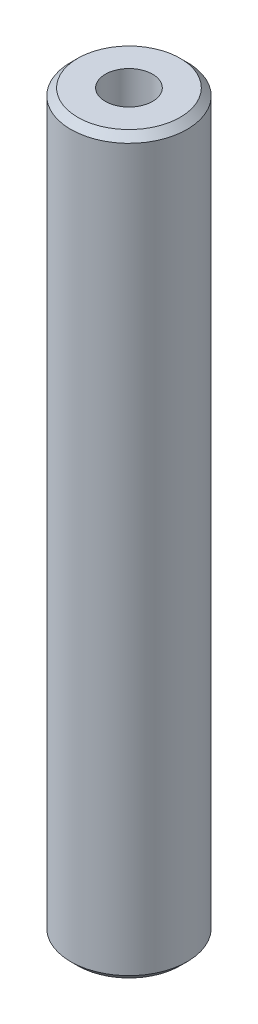
ISO-10303-21;
HEADER;
FILE_DESCRIPTION(('STEP AP214'),'2;1');
FILE_NAME('part.step','',(''),(''),'','','');
FILE_SCHEMA(('AUTOMOTIVE_DESIGN { 1 0 10303 214 1 1 1 1 }'));
ENDSEC;
DATA;
#1=APPLICATION_CONTEXT('core data for automotive mechanical design processes');
#2=APPLICATION_PROTOCOL_DEFINITION('international standard','automotive_design',2000,#1);
#3=PRODUCT_CONTEXT('',#1,'mechanical');
#4=PRODUCT('Part','Part','',(#3));
#5=PRODUCT_RELATED_PRODUCT_CATEGORY('part','',(#4));
#6=PRODUCT_DEFINITION_FORMATION('','',#4);
#7=PRODUCT_DEFINITION_CONTEXT('part definition',#1,'design');
#8=PRODUCT_DEFINITION('design','',#6,#7);
#9=PRODUCT_DEFINITION_SHAPE('','',#8);
#10=(LENGTH_UNIT() NAMED_UNIT(*) SI_UNIT(.MILLI.,.METRE.));
#11=(NAMED_UNIT(*) PLANE_ANGLE_UNIT() SI_UNIT($,.RADIAN.));
#12=(NAMED_UNIT(*) SI_UNIT($,.STERADIAN.) SOLID_ANGLE_UNIT());
#13=UNCERTAINTY_MEASURE_WITH_UNIT(LENGTH_MEASURE(1.E-05),#10,'distance_accuracy_value','');
#14=(GEOMETRIC_REPRESENTATION_CONTEXT(3) GLOBAL_UNCERTAINTY_ASSIGNED_CONTEXT((#13)) GLOBAL_UNIT_ASSIGNED_CONTEXT((#10,
#11,#12)) REPRESENTATION_CONTEXT('',''));
#15=CARTESIAN_POINT('',(0.,0.,0.));
#16=DIRECTION('',(0.,0.,1.));
#17=DIRECTION('',(1.,0.,0.));
#18=AXIS2_PLACEMENT_3D('',#15,#16,#17);
#19=CARTESIAN_POINT('',(0.,600.,0.));
#20=DIRECTION('',(0.,-1.,0.));
#21=DIRECTION('',(0.,0.,-1.));
#22=AXIS2_PLACEMENT_3D('',#19,#20,#21);
#23=CYLINDRICAL_SURFACE('',#22,47.5);
#24=CARTESIAN_POINT('',(0.,594.302308793248,0.));
#25=DIRECTION('',(0.,1.,0.));
#26=DIRECTION('',(0.,0.,1.));
#27=AXIS2_PLACEMENT_3D('',#24,#25,#26);
#28=CIRCLE('',#27,47.5);
#29=CARTESIAN_POINT('',(0.,594.302308793248,47.5));
#30=VERTEX_POINT('',#29);
#31=EDGE_CURVE('E50',#30,#30,#28,.F.);
#32=ORIENTED_EDGE('',*,*,#31,.T.);
#33=EDGE_LOOP('',(#32));
#34=FACE_BOUND('',#33,.T.);
#35=CARTESIAN_POINT('',(0.,5.69769120675245,0.));
#36=DIRECTION('',(0.,1.,0.));
#37=DIRECTION('',(0.,0.,1.));
#38=AXIS2_PLACEMENT_3D('',#35,#36,#37);
#39=CIRCLE('',#38,47.5);
#40=CARTESIAN_POINT('',(0.,5.69769120675245,47.5));
#41=VERTEX_POINT('',#40);
#42=EDGE_CURVE('E51',#41,#41,#39,.T.);
#43=ORIENTED_EDGE('',*,*,#42,.T.);
#44=EDGE_LOOP('',(#43));
#45=FACE_BOUND('',#44,.T.);
#46=ADVANCED_FACE('F39',(#34,#45),#23,.T.);
#47=CARTESIAN_POINT('',(0.,600.,0.));
#48=DIRECTION('',(0.,1.,0.));
#49=DIRECTION('',(0.,0.,1.));
#50=AXIS2_PLACEMENT_3D('',#47,#48,#49);
#51=PLANE('',#50);
#52=CARTESIAN_POINT('',(0.,600.,0.));
#53=DIRECTION('',(0.,1.,0.));
#54=DIRECTION('',(0.,0.,1.));
#55=AXIS2_PLACEMENT_3D('',#52,#53,#54);
#56=CIRCLE('',#55,41.8023087932478);
#57=CARTESIAN_POINT('',(0.,600.,41.8023087932478));
#58=VERTEX_POINT('',#57);
#59=EDGE_CURVE('E54',#58,#58,#56,.T.);
#60=ORIENTED_EDGE('',*,*,#59,.T.);
#61=EDGE_LOOP('',(#60));
#62=FACE_BOUND('',#61,.T.);
#63=CARTESIAN_POINT('',(0.,600.,0.));
#64=DIRECTION('',(0.,1.,0.));
#65=DIRECTION('',(0.,0.,1.));
#66=AXIS2_PLACEMENT_3D('',#63,#64,#65);
#67=CIRCLE('',#66,19.2792824281884);
#68=CARTESIAN_POINT('',(0.,600.,19.2792824281884));
#69=VERTEX_POINT('',#68);
#70=EDGE_CURVE('E58',#69,#69,#67,.T.);
#71=ORIENTED_EDGE('',*,*,#70,.F.);
#72=EDGE_LOOP('',(#71));
#73=FACE_BOUND('',#72,.T.);
#74=ADVANCED_FACE('F69',(#62,#73),#51,.T.);
#75=CARTESIAN_POINT('',(0.,0.,0.));
#76=DIRECTION('',(0.,1.,0.));
#77=DIRECTION('',(0.,0.,1.));
#78=AXIS2_PLACEMENT_3D('',#75,#76,#77);
#79=PLANE('',#78);
#80=CARTESIAN_POINT('',(0.,0.,0.));
#81=DIRECTION('',(0.,1.,0.));
#82=DIRECTION('',(0.,0.,1.));
#83=AXIS2_PLACEMENT_3D('',#80,#81,#82);
#84=CIRCLE('',#83,41.8023087932475);
#85=CARTESIAN_POINT('',(0.,0.,41.8023087932475));
#86=VERTEX_POINT('',#85);
#87=EDGE_CURVE('E10',#86,#86,#84,.F.);
#88=ORIENTED_EDGE('',*,*,#87,.T.);
#89=EDGE_LOOP('',(#88));
#90=FACE_BOUND('',#89,.T.);
#91=CARTESIAN_POINT('',(0.,0.,0.));
#92=DIRECTION('',(0.,1.,0.));
#93=DIRECTION('',(0.,0.,1.));
#94=AXIS2_PLACEMENT_3D('',#91,#92,#93);
#95=CIRCLE('',#94,19.2792824281884);
#96=CARTESIAN_POINT('',(0.,0.,19.2792824281884));
#97=VERTEX_POINT('',#96);
#98=EDGE_CURVE('E63',#97,#97,#95,.T.);
#99=ORIENTED_EDGE('',*,*,#98,.T.);
#100=EDGE_LOOP('',(#99));
#101=FACE_BOUND('',#100,.T.);
#102=ADVANCED_FACE('F75',(#90,#101),#79,.F.);
#103=CARTESIAN_POINT('',(0.,600.,0.));
#104=DIRECTION('',(0.,-1.,0.));
#105=DIRECTION('',(0.,0.,-1.));
#106=AXIS2_PLACEMENT_3D('',#103,#104,#105);
#107=CYLINDRICAL_SURFACE('',#106,19.2792824281884);
#108=ORIENTED_EDGE('',*,*,#70,.T.);
#109=EDGE_LOOP('',(#108));
#110=FACE_BOUND('',#109,.T.);
#111=ORIENTED_EDGE('',*,*,#98,.F.);
#112=EDGE_LOOP('',(#111));
#113=FACE_BOUND('',#112,.T.);
#114=ADVANCED_FACE('F70',(#110,#113),#107,.F.);
#115=CARTESIAN_POINT('',(0.,600.,0.));
#116=DIRECTION('',(0.,-1.,0.));
#117=DIRECTION('',(0.,0.,-1.));
#118=AXIS2_PLACEMENT_3D('',#115,#116,#117);
#119=CONICAL_SURFACE('',#118,41.8023087932478,0.78539816339745);
#120=ORIENTED_EDGE('',*,*,#31,.F.);
#121=EDGE_LOOP('',(#120));
#122=FACE_BOUND('',#121,.T.);
#123=ORIENTED_EDGE('',*,*,#59,.F.);
#124=EDGE_LOOP('',(#123));
#125=FACE_BOUND('',#124,.T.);
#126=ADVANCED_FACE('F81',(#122,#125),#119,.T.);
#127=CARTESIAN_POINT('',(0.,5.69769120675245,0.));
#128=DIRECTION('',(0.,1.,0.));
#129=DIRECTION('',(0.,0.,1.));
#130=AXIS2_PLACEMENT_3D('',#127,#128,#129);
#131=CONICAL_SURFACE('',#130,47.5,0.78539816339745);
#132=CARTESIAN_POINT('',(0.,0.,41.8023087932475));
#133=CARTESIAN_POINT('',(0.,0.0593509500703381,41.8616597433179));
#134=CARTESIAN_POINT('',(0.,0.118701900140676,41.9210106933882));
#135=CARTESIAN_POINT('',(0.,0.237403800281352,42.0397125935289));
#136=CARTESIAN_POINT('',(0.,0.29675475035169,42.0990635435992));
#137=CARTESIAN_POINT('',(0.,0.415456650492365,42.2177654437399));
#138=CARTESIAN_POINT('',(0.,0.474807600562703,42.2771163938102));
#139=CARTESIAN_POINT('',(0.,0.593509500703379,42.3958182939509));
#140=CARTESIAN_POINT('',(0.,0.652860450773718,42.4551692440213));
#141=CARTESIAN_POINT('',(0.,0.771562350914394,42.5738711441619));
#142=CARTESIAN_POINT('',(0.,0.830913300984731,42.6332220942323));
#143=CARTESIAN_POINT('',(0.,0.949615201125407,42.7519239943729));
#144=CARTESIAN_POINT('',(0.,1.00896615119575,42.8112749444433));
#145=CARTESIAN_POINT('',(0.,1.12766805133642,42.929976844584));
#146=CARTESIAN_POINT('',(0.,1.18701900140676,42.9893277946543));
#147=CARTESIAN_POINT('',(0.,1.30572090154744,43.108029694795));
#148=CARTESIAN_POINT('',(0.,1.36507185161777,43.1673806448653));
#149=CARTESIAN_POINT('',(0.,1.48377375175845,43.286082545006));
#150=CARTESIAN_POINT('',(0.,1.54312470182879,43.3454334950763));
#151=CARTESIAN_POINT('',(0.,1.66182660196946,43.464135395217));
#152=CARTESIAN_POINT('',(0.,1.7211775520398,43.5234863452873));
#153=CARTESIAN_POINT('',(0.,1.83987945218048,43.642188245428));
#154=CARTESIAN_POINT('',(0.,1.89923040225082,43.7015391954984));
#155=CARTESIAN_POINT('',(0.,2.01793230239149,43.820241095639));
#156=CARTESIAN_POINT('',(0.,2.07728325246183,43.8795920457094));
#157=CARTESIAN_POINT('',(0.,2.19598515260251,43.9982939458501));
#158=CARTESIAN_POINT('',(0.,2.25533610267284,44.0576448959204));
#159=CARTESIAN_POINT('',(0.,2.37403800281352,44.1763467960611));
#160=CARTESIAN_POINT('',(0.,2.43338895288386,44.2356977461314));
#161=CARTESIAN_POINT('',(0.,2.55209085302454,44.3543996462721));
#162=CARTESIAN_POINT('',(0.,2.61144180309487,44.4137505963424));
#163=CARTESIAN_POINT('',(0.,2.73014370323555,44.5324524964831));
#164=CARTESIAN_POINT('',(0.,2.78949465330589,44.5918034465534));
#165=CARTESIAN_POINT('',(0.,2.90819655344656,44.7105053466941));
#166=CARTESIAN_POINT('',(0.,2.9675475035169,44.7698562967644));
#167=CARTESIAN_POINT('',(0.,3.08624940365758,44.8885581969051));
#168=CARTESIAN_POINT('',(0.,3.14560035372792,44.9479091469755));
#169=CARTESIAN_POINT('',(0.,3.26430225386859,45.0666110471161));
#170=CARTESIAN_POINT('',(0.,3.32365320393893,45.1259619971865));
#171=CARTESIAN_POINT('',(0.,3.44235510407961,45.2446638973272));
#172=CARTESIAN_POINT('',(0.,3.50170605414994,45.3040148473975));
#173=CARTESIAN_POINT('',(0.,3.62040795429062,45.4227167475382));
#174=CARTESIAN_POINT('',(0.,3.67975890436096,45.4820676976085));
#175=CARTESIAN_POINT('',(0.,3.79846080450164,45.6007695977492));
#176=CARTESIAN_POINT('',(0.,3.85781175457197,45.6601205478195));
#177=CARTESIAN_POINT('',(0.,3.97651365471265,45.7788224479602));
#178=CARTESIAN_POINT('',(0.,4.03586460478299,45.8381733980305));
#179=CARTESIAN_POINT('',(0.,4.15456650492366,45.9568752981712));
#180=CARTESIAN_POINT('',(0.,4.213917454994,46.0162262482416));
#181=CARTESIAN_POINT('',(0.,4.33261935513468,46.1349281483822));
#182=CARTESIAN_POINT('',(0.,4.39197030520501,46.1942790984526));
#183=CARTESIAN_POINT('',(0.,4.51067220534569,46.3129809985932));
#184=CARTESIAN_POINT('',(0.,4.57002315541603,46.3723319486636));
#185=CARTESIAN_POINT('',(0.,4.68872505555671,46.4910338488043));
#186=CARTESIAN_POINT('',(0.,4.74807600562704,46.5503847988746));
#187=CARTESIAN_POINT('',(0.,4.86677790576772,46.6690866990153));
#188=CARTESIAN_POINT('',(0.,4.92612885583806,46.7284376490856));
#189=CARTESIAN_POINT('',(0.,5.04483075597873,46.8471395492263));
#190=CARTESIAN_POINT('',(0.,5.10418170604907,46.9064904992966));
#191=CARTESIAN_POINT('',(0.,5.22288360618975,47.0251923994373));
#192=CARTESIAN_POINT('',(0.,5.28223455626009,47.0845433495076));
#193=CARTESIAN_POINT('',(0.,5.40093645640076,47.2032452496483));
#194=CARTESIAN_POINT('',(0.,5.4602874064711,47.2625961997187));
#195=CARTESIAN_POINT('',(0.,5.57898930661178,47.3812980998593));
#196=CARTESIAN_POINT('',(0.,5.63834025668212,47.4406490499297));
#197=CARTESIAN_POINT('',(0.,5.69769120675245,47.5));
#198=B_SPLINE_CURVE_WITH_KNOTS('',3,(#132,#133,#134,#135,#136,#137,#138,#139,#140,#141,#142,
#143,#144,#145,#146,#147,#148,#149,#150,#151,#152,#153,#154,#155,#156,#157,#158,#159,#160,#161,
#162,#163,#164,#165,#166,#167,#168,#169,#170,#171,#172,#173,#174,#175,#176,#177,#178,#179,#180,
#181,#182,#183,#184,#185,#186,#187,#188,#189,#190,#191,#192,#193,#194,#195,#196,#197),
.UNSPECIFIED.,.F.,.F.,(4,2,2,2,2,2,2,2,2,2,2,2,2,2,2,2,2,2,2,2,2,2,2,2,2,2,2,2,2,2,2,2,4),(0.,
0.251804755587599,0.503609511175203,0.755414266762807,1.00721902235041,1.25902377793801,
1.51082853352561,1.76263328911321,2.01443804470081,2.26624280028841,2.51804755587602,
2.76985231146362,3.02165706705122,3.27346182263883,3.52526657822642,3.77707133381403,
4.02887608940163,4.28068084498923,4.53248560057683,4.78429035616443,5.03609511175204,
5.28789986733964,5.53970462292724,5.79150937851485,6.04331413410244,6.29511888969005,
6.54692364527765,6.79872840086525,7.05053315645286,7.30233791204046,7.55414266762806,
7.80594742321566,8.05775217880326),.UNSPECIFIED.);
#199=EDGE_CURVE('BSEAM45',#86,#41,#198,.T.);
#200=ORIENTED_EDGE('',*,*,#87,.F.);
#201=ORIENTED_EDGE('',*,*,#42,.F.);
#202=ORIENTED_EDGE('',*,*,#199,.T.);
#203=ORIENTED_EDGE('',*,*,#199,.F.);
#204=EDGE_LOOP('',(#200,#202,#201,#203));
#205=FACE_BOUND('',#204,.T.);
#206=ADVANCED_FACE('F45',(#205),#131,.T.);
#207=CLOSED_SHELL('',(#46,#74,#102,#114,#126,#206));
#208=MANIFOLD_SOLID_BREP('B2',#207);
#209=ADVANCED_BREP_SHAPE_REPRESENTATION('',(#18,#208),#14);
#210=SHAPE_DEFINITION_REPRESENTATION(#9,#209);
ENDSEC;
END-ISO-10303-21;
